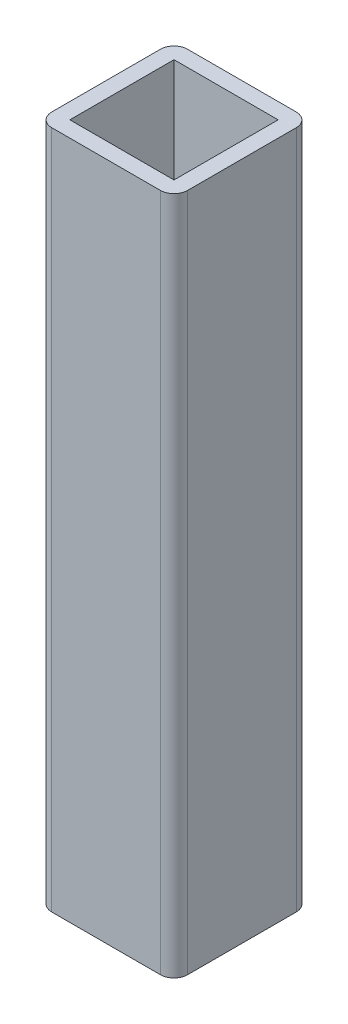
ISO-10303-21;
HEADER;
FILE_DESCRIPTION(('STEP AP214'),'2;1');
FILE_NAME('part.step','',(''),(''),'','','');
FILE_SCHEMA(('AUTOMOTIVE_DESIGN { 1 0 10303 214 1 1 1 1 }'));
ENDSEC;
DATA;
#1=APPLICATION_CONTEXT('core data for automotive mechanical design processes');
#2=APPLICATION_PROTOCOL_DEFINITION('international standard','automotive_design',2000,#1);
#3=PRODUCT_CONTEXT('',#1,'mechanical');
#4=PRODUCT('Part','Part','',(#3));
#5=PRODUCT_RELATED_PRODUCT_CATEGORY('part','',(#4));
#6=PRODUCT_DEFINITION_FORMATION('','',#4);
#7=PRODUCT_DEFINITION_CONTEXT('part definition',#1,'design');
#8=PRODUCT_DEFINITION('design','',#6,#7);
#9=PRODUCT_DEFINITION_SHAPE('','',#8);
#10=(LENGTH_UNIT() NAMED_UNIT(*) SI_UNIT(.MILLI.,.METRE.));
#11=(NAMED_UNIT(*) PLANE_ANGLE_UNIT() SI_UNIT($,.RADIAN.));
#12=(NAMED_UNIT(*) SI_UNIT($,.STERADIAN.) SOLID_ANGLE_UNIT());
#13=UNCERTAINTY_MEASURE_WITH_UNIT(LENGTH_MEASURE(1.E-05),#10,'distance_accuracy_value','');
#14=(GEOMETRIC_REPRESENTATION_CONTEXT(3) GLOBAL_UNCERTAINTY_ASSIGNED_CONTEXT((#13)) GLOBAL_UNIT_ASSIGNED_CONTEXT((#10,
#11,#12)) REPRESENTATION_CONTEXT('',''));
#15=CARTESIAN_POINT('',(0.,0.,0.));
#16=DIRECTION('',(0.,0.,1.));
#17=DIRECTION('',(1.,0.,0.));
#18=AXIS2_PLACEMENT_3D('',#15,#16,#17);
#19=CARTESIAN_POINT('',(12.,150.,-12.));
#20=DIRECTION('',(0.,-1.,0.));
#21=DIRECTION('',(0.,0.,-1.));
#22=AXIS2_PLACEMENT_3D('',#19,#20,#21);
#23=PLANE('',#22);
#24=CARTESIAN_POINT('',(12.,150.,-12.));
#25=DIRECTION('',(0.,1.,0.));
#26=DIRECTION('',(0.,0.,-1.));
#27=AXIS2_PLACEMENT_3D('',#24,#25,#26);
#28=CIRCLE('',#27,3.);
#29=CARTESIAN_POINT('',(15.,150.,-12.));
#30=VERTEX_POINT('',#29);
#31=CARTESIAN_POINT('',(12.,150.,-15.));
#32=VERTEX_POINT('',#31);
#33=EDGE_CURVE('E177',#30,#32,#28,.T.);
#34=ORIENTED_EDGE('',*,*,#33,.T.);
#35=DIRECTION('',(-1.,0.,0.));
#36=VECTOR('',#35,1.);
#37=CARTESIAN_POINT('',(12.,150.,-15.));
#38=LINE('',#37,#36);
#39=CARTESIAN_POINT('',(-12.,150.,-15.));
#40=VERTEX_POINT('',#39);
#41=EDGE_CURVE('E181',#32,#40,#38,.T.);
#42=ORIENTED_EDGE('',*,*,#41,.T.);
#43=CARTESIAN_POINT('',(-12.,150.,-12.));
#44=DIRECTION('',(0.,1.,0.));
#45=DIRECTION('',(0.,0.,1.));
#46=AXIS2_PLACEMENT_3D('',#43,#44,#45);
#47=CIRCLE('',#46,3.);
#48=CARTESIAN_POINT('',(-15.,150.,-12.));
#49=VERTEX_POINT('',#48);
#50=EDGE_CURVE('E185',#40,#49,#47,.T.);
#51=ORIENTED_EDGE('',*,*,#50,.T.);
#52=DIRECTION('',(0.,0.,1.));
#53=VECTOR('',#52,1.);
#54=CARTESIAN_POINT('',(-15.,150.,-12.));
#55=LINE('',#54,#53);
#56=CARTESIAN_POINT('',(-15.,150.,12.));
#57=VERTEX_POINT('',#56);
#58=EDGE_CURVE('E188',#49,#57,#55,.T.);
#59=ORIENTED_EDGE('',*,*,#58,.T.);
#60=CARTESIAN_POINT('',(-12.,150.,12.));
#61=DIRECTION('',(0.,1.,0.));
#62=DIRECTION('',(0.,0.,-1.));
#63=AXIS2_PLACEMENT_3D('',#60,#61,#62);
#64=CIRCLE('',#63,3.);
#65=CARTESIAN_POINT('',(-12.,150.,15.));
#66=VERTEX_POINT('',#65);
#67=EDGE_CURVE('E191',#57,#66,#64,.T.);
#68=ORIENTED_EDGE('',*,*,#67,.T.);
#69=DIRECTION('',(1.,0.,0.));
#70=VECTOR('',#69,1.);
#71=CARTESIAN_POINT('',(12.,150.,15.));
#72=LINE('',#71,#70);
#73=CARTESIAN_POINT('',(12.,150.,15.));
#74=VERTEX_POINT('',#73);
#75=EDGE_CURVE('E194',#66,#74,#72,.T.);
#76=ORIENTED_EDGE('',*,*,#75,.T.);
#77=CARTESIAN_POINT('',(12.,150.,12.));
#78=DIRECTION('',(0.,1.,0.));
#79=DIRECTION('',(0.,0.,-1.));
#80=AXIS2_PLACEMENT_3D('',#77,#78,#79);
#81=CIRCLE('',#80,3.);
#82=CARTESIAN_POINT('',(15.,150.,12.));
#83=VERTEX_POINT('',#82);
#84=EDGE_CURVE('E197',#74,#83,#81,.T.);
#85=ORIENTED_EDGE('',*,*,#84,.T.);
#86=DIRECTION('',(0.,0.,-1.));
#87=VECTOR('',#86,1.);
#88=CARTESIAN_POINT('',(15.,150.,-12.));
#89=LINE('',#88,#87);
#90=EDGE_CURVE('E200',#83,#30,#89,.T.);
#91=ORIENTED_EDGE('',*,*,#90,.T.);
#92=EDGE_LOOP('',(#34,#42,#51,#59,#68,#76,#85,#91));
#93=FACE_BOUND('',#92,.T.);
#94=DIRECTION('',(0.,0.,1.));
#95=VECTOR('',#94,1.);
#96=CARTESIAN_POINT('',(-11.5,150.,-11.5));
#97=LINE('',#96,#95);
#98=CARTESIAN_POINT('',(-11.5,150.,-11.5));
#99=VERTEX_POINT('',#98);
#100=CARTESIAN_POINT('',(-11.5,150.,11.5));
#101=VERTEX_POINT('',#100);
#102=EDGE_CURVE('E129',#99,#101,#97,.T.);
#103=ORIENTED_EDGE('',*,*,#102,.F.);
#104=DIRECTION('',(-1.,0.,0.));
#105=VECTOR('',#104,1.);
#106=CARTESIAN_POINT('',(11.5,150.,-11.5));
#107=LINE('',#106,#105);
#108=CARTESIAN_POINT('',(11.5,150.,-11.5));
#109=VERTEX_POINT('',#108);
#110=EDGE_CURVE('E155',#109,#99,#107,.T.);
#111=ORIENTED_EDGE('',*,*,#110,.F.);
#112=DIRECTION('',(0.,0.,-1.));
#113=VECTOR('',#112,1.);
#114=CARTESIAN_POINT('',(11.5,150.,-11.5));
#115=LINE('',#114,#113);
#116=CARTESIAN_POINT('',(11.5,150.,11.5));
#117=VERTEX_POINT('',#116);
#118=EDGE_CURVE('E151',#117,#109,#115,.T.);
#119=ORIENTED_EDGE('',*,*,#118,.F.);
#120=DIRECTION('',(1.,0.,0.));
#121=VECTOR('',#120,1.);
#122=CARTESIAN_POINT('',(11.5,150.,11.5));
#123=LINE('',#122,#121);
#124=EDGE_CURVE('E138',#101,#117,#123,.T.);
#125=ORIENTED_EDGE('',*,*,#124,.F.);
#126=EDGE_LOOP('',(#103,#111,#119,#125));
#127=FACE_BOUND('',#126,.T.);
#128=ADVANCED_FACE('F39',(#93,#127),#23,.F.);
#129=CARTESIAN_POINT('',(12.,0.,-12.));
#130=DIRECTION('',(0.,-1.,0.));
#131=DIRECTION('',(0.,0.,-1.));
#132=AXIS2_PLACEMENT_3D('',#129,#130,#131);
#133=PLANE('',#132);
#134=CARTESIAN_POINT('',(12.,0.,-12.));
#135=DIRECTION('',(0.,1.,0.));
#136=DIRECTION('',(0.,0.,-1.));
#137=AXIS2_PLACEMENT_3D('',#134,#135,#136);
#138=CIRCLE('',#137,3.);
#139=CARTESIAN_POINT('',(15.,0.,-12.));
#140=VERTEX_POINT('',#139);
#141=CARTESIAN_POINT('',(12.,0.,-15.));
#142=VERTEX_POINT('',#141);
#143=EDGE_CURVE('E147',#140,#142,#138,.T.);
#144=ORIENTED_EDGE('',*,*,#143,.F.);
#145=DIRECTION('',(0.,0.,-1.));
#146=VECTOR('',#145,1.);
#147=CARTESIAN_POINT('',(15.,0.,-12.));
#148=LINE('',#147,#146);
#149=CARTESIAN_POINT('',(15.,0.,12.));
#150=VERTEX_POINT('',#149);
#151=EDGE_CURVE('E182',#150,#140,#148,.T.);
#152=ORIENTED_EDGE('',*,*,#151,.F.);
#153=CARTESIAN_POINT('',(12.,0.,12.));
#154=DIRECTION('',(0.,1.,0.));
#155=DIRECTION('',(0.,0.,-1.));
#156=AXIS2_PLACEMENT_3D('',#153,#154,#155);
#157=CIRCLE('',#156,3.);
#158=CARTESIAN_POINT('',(12.,0.,15.));
#159=VERTEX_POINT('',#158);
#160=EDGE_CURVE('E222',#159,#150,#157,.T.);
#161=ORIENTED_EDGE('',*,*,#160,.F.);
#162=DIRECTION('',(1.,0.,0.));
#163=VECTOR('',#162,1.);
#164=CARTESIAN_POINT('',(12.,0.,15.));
#165=LINE('',#164,#163);
#166=CARTESIAN_POINT('',(-12.,0.,15.));
#167=VERTEX_POINT('',#166);
#168=EDGE_CURVE('E219',#167,#159,#165,.T.);
#169=ORIENTED_EDGE('',*,*,#168,.F.);
#170=CARTESIAN_POINT('',(-12.,0.,12.));
#171=DIRECTION('',(0.,1.,0.));
#172=DIRECTION('',(0.,0.,-1.));
#173=AXIS2_PLACEMENT_3D('',#170,#171,#172);
#174=CIRCLE('',#173,3.);
#175=CARTESIAN_POINT('',(-15.,0.,12.));
#176=VERTEX_POINT('',#175);
#177=EDGE_CURVE('E216',#176,#167,#174,.T.);
#178=ORIENTED_EDGE('',*,*,#177,.F.);
#179=DIRECTION('',(0.,0.,1.));
#180=VECTOR('',#179,1.);
#181=CARTESIAN_POINT('',(-15.,0.,-12.));
#182=LINE('',#181,#180);
#183=CARTESIAN_POINT('',(-15.,0.,-12.));
#184=VERTEX_POINT('',#183);
#185=EDGE_CURVE('E213',#184,#176,#182,.T.);
#186=ORIENTED_EDGE('',*,*,#185,.F.);
#187=CARTESIAN_POINT('',(-12.,0.,-12.));
#188=DIRECTION('',(0.,1.,0.));
#189=DIRECTION('',(0.,0.,1.));
#190=AXIS2_PLACEMENT_3D('',#187,#188,#189);
#191=CIRCLE('',#190,3.);
#192=CARTESIAN_POINT('',(-12.,0.,-15.));
#193=VERTEX_POINT('',#192);
#194=EDGE_CURVE('E210',#193,#184,#191,.T.);
#195=ORIENTED_EDGE('',*,*,#194,.F.);
#196=DIRECTION('',(-1.,0.,0.));
#197=VECTOR('',#196,1.);
#198=CARTESIAN_POINT('',(12.,0.,-15.));
#199=LINE('',#198,#197);
#200=EDGE_CURVE('E207',#142,#193,#199,.T.);
#201=ORIENTED_EDGE('',*,*,#200,.F.);
#202=EDGE_LOOP('',(#144,#152,#161,#169,#178,#186,#195,#201));
#203=FACE_BOUND('',#202,.T.);
#204=DIRECTION('',(-1.,0.,0.));
#205=VECTOR('',#204,1.);
#206=CARTESIAN_POINT('',(11.5,0.,-11.5));
#207=LINE('',#206,#205);
#208=CARTESIAN_POINT('',(11.5,0.,-11.5));
#209=VERTEX_POINT('',#208);
#210=CARTESIAN_POINT('',(-11.5,0.,-11.5));
#211=VERTEX_POINT('',#210);
#212=EDGE_CURVE('E139',#209,#211,#207,.T.);
#213=ORIENTED_EDGE('',*,*,#212,.T.);
#214=DIRECTION('',(0.,0.,1.));
#215=VECTOR('',#214,1.);
#216=CARTESIAN_POINT('',(-11.5,0.,-11.5));
#217=LINE('',#216,#215);
#218=CARTESIAN_POINT('',(-11.5,0.,11.5));
#219=VERTEX_POINT('',#218);
#220=EDGE_CURVE('E63',#211,#219,#217,.T.);
#221=ORIENTED_EDGE('',*,*,#220,.T.);
#222=DIRECTION('',(1.,0.,0.));
#223=VECTOR('',#222,1.);
#224=CARTESIAN_POINT('',(11.5,0.,11.5));
#225=LINE('',#224,#223);
#226=CARTESIAN_POINT('',(11.5,0.,11.5));
#227=VERTEX_POINT('',#226);
#228=EDGE_CURVE('E145',#219,#227,#225,.T.);
#229=ORIENTED_EDGE('',*,*,#228,.T.);
#230=DIRECTION('',(0.,0.,-1.));
#231=VECTOR('',#230,1.);
#232=CARTESIAN_POINT('',(11.5,0.,-11.5));
#233=LINE('',#232,#231);
#234=EDGE_CURVE('E164',#227,#209,#233,.T.);
#235=ORIENTED_EDGE('',*,*,#234,.T.);
#236=EDGE_LOOP('',(#213,#221,#229,#235));
#237=FACE_BOUND('',#236,.T.);
#238=ADVANCED_FACE('F261',(#203,#237),#133,.T.);
#239=CARTESIAN_POINT('',(12.,150.,-12.));
#240=DIRECTION('',(0.,-1.,0.));
#241=DIRECTION('',(0.,0.,-1.));
#242=AXIS2_PLACEMENT_3D('',#239,#240,#241);
#243=CYLINDRICAL_SURFACE('',#242,3.);
#244=ORIENTED_EDGE('',*,*,#143,.T.);
#245=DIRECTION('',(0.,-1.,0.));
#246=VECTOR('',#245,1.);
#247=CARTESIAN_POINT('',(12.,150.,-15.));
#248=LINE('',#247,#246);
#249=EDGE_CURVE('E11',#32,#142,#248,.T.);
#250=ORIENTED_EDGE('',*,*,#249,.F.);
#251=ORIENTED_EDGE('',*,*,#33,.F.);
#252=DIRECTION('',(0.,-1.,0.));
#253=VECTOR('',#252,1.);
#254=CARTESIAN_POINT('',(15.,150.,-12.));
#255=LINE('',#254,#253);
#256=EDGE_CURVE('E203',#30,#140,#255,.T.);
#257=ORIENTED_EDGE('',*,*,#256,.T.);
#258=EDGE_LOOP('',(#244,#250,#251,#257));
#259=FACE_BOUND('',#258,.T.);
#260=ADVANCED_FACE('F41',(#259),#243,.T.);
#261=CARTESIAN_POINT('',(12.,150.,-15.));
#262=DIRECTION('',(0.,0.,1.));
#263=DIRECTION('',(1.,0.,0.));
#264=AXIS2_PLACEMENT_3D('',#261,#262,#263);
#265=PLANE('',#264);
#266=ORIENTED_EDGE('',*,*,#200,.T.);
#267=DIRECTION('',(0.,-1.,0.));
#268=VECTOR('',#267,1.);
#269=CARTESIAN_POINT('',(-12.,150.,-15.));
#270=LINE('',#269,#268);
#271=EDGE_CURVE('E48',#40,#193,#270,.T.);
#272=ORIENTED_EDGE('',*,*,#271,.F.);
#273=ORIENTED_EDGE('',*,*,#41,.F.);
#274=ORIENTED_EDGE('',*,*,#249,.T.);
#275=EDGE_LOOP('',(#266,#272,#273,#274));
#276=FACE_BOUND('',#275,.T.);
#277=ADVANCED_FACE('F278',(#276),#265,.F.);
#278=CARTESIAN_POINT('',(-12.,150.,-12.));
#279=DIRECTION('',(0.,-1.,0.));
#280=DIRECTION('',(0.,0.,-1.));
#281=AXIS2_PLACEMENT_3D('',#278,#279,#280);
#282=CYLINDRICAL_SURFACE('',#281,3.);
#283=ORIENTED_EDGE('',*,*,#194,.T.);
#284=DIRECTION('',(0.,-1.,0.));
#285=VECTOR('',#284,1.);
#286=CARTESIAN_POINT('',(-15.,150.,-12.));
#287=LINE('',#286,#285);
#288=EDGE_CURVE('E246',#49,#184,#287,.T.);
#289=ORIENTED_EDGE('',*,*,#288,.F.);
#290=ORIENTED_EDGE('',*,*,#50,.F.);
#291=ORIENTED_EDGE('',*,*,#271,.T.);
#292=EDGE_LOOP('',(#283,#289,#290,#291));
#293=FACE_BOUND('',#292,.T.);
#294=ADVANCED_FACE('F255',(#293),#282,.T.);
#295=CARTESIAN_POINT('',(-15.,150.,-12.));
#296=DIRECTION('',(1.,0.,0.));
#297=DIRECTION('',(0.,0.,-1.));
#298=AXIS2_PLACEMENT_3D('',#295,#296,#297);
#299=PLANE('',#298);
#300=ORIENTED_EDGE('',*,*,#185,.T.);
#301=DIRECTION('',(0.,-1.,0.));
#302=VECTOR('',#301,1.);
#303=CARTESIAN_POINT('',(-15.,150.,12.));
#304=LINE('',#303,#302);
#305=EDGE_CURVE('E242',#57,#176,#304,.T.);
#306=ORIENTED_EDGE('',*,*,#305,.F.);
#307=ORIENTED_EDGE('',*,*,#58,.F.);
#308=ORIENTED_EDGE('',*,*,#288,.T.);
#309=EDGE_LOOP('',(#300,#306,#307,#308));
#310=FACE_BOUND('',#309,.T.);
#311=ADVANCED_FACE('F267',(#310),#299,.F.);
#312=CARTESIAN_POINT('',(-12.,150.,12.));
#313=DIRECTION('',(0.,-1.,0.));
#314=DIRECTION('',(0.,0.,-1.));
#315=AXIS2_PLACEMENT_3D('',#312,#313,#314);
#316=CYLINDRICAL_SURFACE('',#315,3.);
#317=ORIENTED_EDGE('',*,*,#177,.T.);
#318=DIRECTION('',(0.,-1.,0.));
#319=VECTOR('',#318,1.);
#320=CARTESIAN_POINT('',(-12.,150.,15.));
#321=LINE('',#320,#319);
#322=EDGE_CURVE('E238',#66,#167,#321,.T.);
#323=ORIENTED_EDGE('',*,*,#322,.F.);
#324=ORIENTED_EDGE('',*,*,#67,.F.);
#325=ORIENTED_EDGE('',*,*,#305,.T.);
#326=EDGE_LOOP('',(#317,#323,#324,#325));
#327=FACE_BOUND('',#326,.T.);
#328=ADVANCED_FACE('F271',(#327),#316,.T.);
#329=CARTESIAN_POINT('',(12.,150.,15.));
#330=DIRECTION('',(0.,0.,-1.));
#331=DIRECTION('',(-1.,0.,0.));
#332=AXIS2_PLACEMENT_3D('',#329,#330,#331);
#333=PLANE('',#332);
#334=ORIENTED_EDGE('',*,*,#168,.T.);
#335=DIRECTION('',(0.,-1.,0.));
#336=VECTOR('',#335,1.);
#337=CARTESIAN_POINT('',(12.,150.,15.));
#338=LINE('',#337,#336);
#339=EDGE_CURVE('E234',#74,#159,#338,.T.);
#340=ORIENTED_EDGE('',*,*,#339,.F.);
#341=ORIENTED_EDGE('',*,*,#75,.F.);
#342=ORIENTED_EDGE('',*,*,#322,.T.);
#343=EDGE_LOOP('',(#334,#340,#341,#342));
#344=FACE_BOUND('',#343,.T.);
#345=ADVANCED_FACE('F291',(#344),#333,.F.);
#346=CARTESIAN_POINT('',(12.,150.,12.));
#347=DIRECTION('',(0.,-1.,0.));
#348=DIRECTION('',(0.,0.,-1.));
#349=AXIS2_PLACEMENT_3D('',#346,#347,#348);
#350=CYLINDRICAL_SURFACE('',#349,3.);
#351=ORIENTED_EDGE('',*,*,#160,.T.);
#352=DIRECTION('',(0.,-1.,0.));
#353=VECTOR('',#352,1.);
#354=CARTESIAN_POINT('',(15.,150.,12.));
#355=LINE('',#354,#353);
#356=EDGE_CURVE('E230',#83,#150,#355,.T.);
#357=ORIENTED_EDGE('',*,*,#356,.F.);
#358=ORIENTED_EDGE('',*,*,#84,.F.);
#359=ORIENTED_EDGE('',*,*,#339,.T.);
#360=EDGE_LOOP('',(#351,#357,#358,#359));
#361=FACE_BOUND('',#360,.T.);
#362=ADVANCED_FACE('F289',(#361),#350,.T.);
#363=CARTESIAN_POINT('',(15.,150.,-12.));
#364=DIRECTION('',(-1.,0.,0.));
#365=DIRECTION('',(0.,0.,1.));
#366=AXIS2_PLACEMENT_3D('',#363,#364,#365);
#367=PLANE('',#366);
#368=ORIENTED_EDGE('',*,*,#151,.T.);
#369=ORIENTED_EDGE('',*,*,#256,.F.);
#370=ORIENTED_EDGE('',*,*,#90,.F.);
#371=ORIENTED_EDGE('',*,*,#356,.T.);
#372=EDGE_LOOP('',(#368,#369,#370,#371));
#373=FACE_BOUND('',#372,.T.);
#374=ADVANCED_FACE('F284',(#373),#367,.F.);
#375=CARTESIAN_POINT('',(-11.5,150.,-11.5));
#376=DIRECTION('',(1.,0.,0.));
#377=DIRECTION('',(0.,0.,-1.));
#378=AXIS2_PLACEMENT_3D('',#375,#376,#377);
#379=PLANE('',#378);
#380=ORIENTED_EDGE('',*,*,#220,.F.);
#381=DIRECTION('',(0.,-1.,0.));
#382=VECTOR('',#381,1.);
#383=CARTESIAN_POINT('',(-11.5,150.,-11.5));
#384=LINE('',#383,#382);
#385=EDGE_CURVE('E133',#99,#211,#384,.T.);
#386=ORIENTED_EDGE('',*,*,#385,.F.);
#387=ORIENTED_EDGE('',*,*,#102,.T.);
#388=DIRECTION('',(0.,-1.,0.));
#389=VECTOR('',#388,1.);
#390=CARTESIAN_POINT('',(-11.5,150.,11.5));
#391=LINE('',#390,#389);
#392=EDGE_CURVE('E132',#101,#219,#391,.T.);
#393=ORIENTED_EDGE('',*,*,#392,.T.);
#394=EDGE_LOOP('',(#380,#386,#387,#393));
#395=FACE_BOUND('',#394,.T.);
#396=ADVANCED_FACE('F131',(#395),#379,.T.);
#397=CARTESIAN_POINT('',(11.5,150.,11.5));
#398=DIRECTION('',(0.,0.,-1.));
#399=DIRECTION('',(-1.,0.,0.));
#400=AXIS2_PLACEMENT_3D('',#397,#398,#399);
#401=PLANE('',#400);
#402=ORIENTED_EDGE('',*,*,#228,.F.);
#403=ORIENTED_EDGE('',*,*,#392,.F.);
#404=ORIENTED_EDGE('',*,*,#124,.T.);
#405=DIRECTION('',(0.,-1.,0.));
#406=VECTOR('',#405,1.);
#407=CARTESIAN_POINT('',(11.5,150.,11.5));
#408=LINE('',#407,#406);
#409=EDGE_CURVE('E148',#117,#227,#408,.T.);
#410=ORIENTED_EDGE('',*,*,#409,.T.);
#411=EDGE_LOOP('',(#402,#403,#404,#410));
#412=FACE_BOUND('',#411,.T.);
#413=ADVANCED_FACE('F142',(#412),#401,.T.);
#414=CARTESIAN_POINT('',(11.5,150.,-11.5));
#415=DIRECTION('',(-1.,0.,0.));
#416=DIRECTION('',(0.,0.,1.));
#417=AXIS2_PLACEMENT_3D('',#414,#415,#416);
#418=PLANE('',#417);
#419=ORIENTED_EDGE('',*,*,#234,.F.);
#420=ORIENTED_EDGE('',*,*,#409,.F.);
#421=ORIENTED_EDGE('',*,*,#118,.T.);
#422=DIRECTION('',(0.,-1.,0.));
#423=VECTOR('',#422,1.);
#424=CARTESIAN_POINT('',(11.5,150.,-11.5));
#425=LINE('',#424,#423);
#426=EDGE_CURVE('E55',#109,#209,#425,.T.);
#427=ORIENTED_EDGE('',*,*,#426,.T.);
#428=EDGE_LOOP('',(#419,#420,#421,#427));
#429=FACE_BOUND('',#428,.T.);
#430=ADVANCED_FACE('F316',(#429),#418,.T.);
#431=CARTESIAN_POINT('',(11.5,150.,-11.5));
#432=DIRECTION('',(0.,0.,1.));
#433=DIRECTION('',(1.,0.,0.));
#434=AXIS2_PLACEMENT_3D('',#431,#432,#433);
#435=PLANE('',#434);
#436=ORIENTED_EDGE('',*,*,#212,.F.);
#437=ORIENTED_EDGE('',*,*,#426,.F.);
#438=ORIENTED_EDGE('',*,*,#110,.T.);
#439=ORIENTED_EDGE('',*,*,#385,.T.);
#440=EDGE_LOOP('',(#436,#437,#438,#439));
#441=FACE_BOUND('',#440,.T.);
#442=ADVANCED_FACE('F320',(#441),#435,.T.);
#443=CLOSED_SHELL('',(#128,#238,#260,#277,#294,#311,#328,#345,#362,#374,#396,#413,#430,#442));
#444=MANIFOLD_SOLID_BREP('B2',#443);
#445=ADVANCED_BREP_SHAPE_REPRESENTATION('',(#18,#444),#14);
#446=SHAPE_DEFINITION_REPRESENTATION(#9,#445);
ENDSEC;
END-ISO-10303-21;
